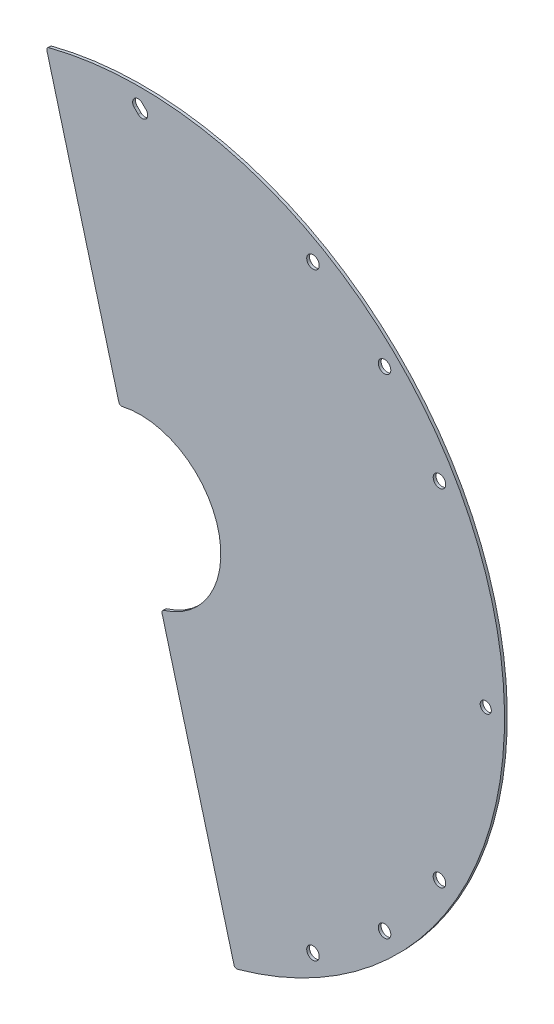
ISO-10303-21;
HEADER;
FILE_DESCRIPTION(('STEP AP214'),'2;1');
FILE_NAME('part.step','',(''),(''),'','','');
FILE_SCHEMA(('AUTOMOTIVE_DESIGN { 1 0 10303 214 1 1 1 1 }'));
ENDSEC;
DATA;
#1=APPLICATION_CONTEXT('core data for automotive mechanical design processes');
#2=APPLICATION_PROTOCOL_DEFINITION('international standard','automotive_design',2000,#1);
#3=PRODUCT_CONTEXT('',#1,'mechanical');
#4=PRODUCT('Part','Part','',(#3));
#5=PRODUCT_RELATED_PRODUCT_CATEGORY('part','',(#4));
#6=PRODUCT_DEFINITION_FORMATION('','',#4);
#7=PRODUCT_DEFINITION_CONTEXT('part definition',#1,'design');
#8=PRODUCT_DEFINITION('design','',#6,#7);
#9=PRODUCT_DEFINITION_SHAPE('','',#8);
#10=(LENGTH_UNIT() NAMED_UNIT(*) SI_UNIT(.MILLI.,.METRE.));
#11=(NAMED_UNIT(*) PLANE_ANGLE_UNIT() SI_UNIT($,.RADIAN.));
#12=(NAMED_UNIT(*) SI_UNIT($,.STERADIAN.) SOLID_ANGLE_UNIT());
#13=UNCERTAINTY_MEASURE_WITH_UNIT(LENGTH_MEASURE(1.E-05),#10,'distance_accuracy_value','');
#14=(GEOMETRIC_REPRESENTATION_CONTEXT(3) GLOBAL_UNCERTAINTY_ASSIGNED_CONTEXT((#13)) GLOBAL_UNIT_ASSIGNED_CONTEXT((#10,
#11,#12)) REPRESENTATION_CONTEXT('',''));
#15=CARTESIAN_POINT('',(0.,0.,0.));
#16=DIRECTION('',(0.,0.,1.));
#17=DIRECTION('',(1.,0.,0.));
#18=AXIS2_PLACEMENT_3D('',#15,#16,#17);
#19=CARTESIAN_POINT('',(-33.9052949084303,126.536283243868,0.999999999999994));
#20=DIRECTION('',(0.,0.,1.));
#21=DIRECTION('',(1.,0.,0.));
#22=AXIS2_PLACEMENT_3D('',#19,#20,#21);
#23=PLANE('',#22);
#24=CARTESIAN_POINT('',(0.,0.,0.999999999999987));
#25=DIRECTION('',(0.,0.,-1.));
#26=DIRECTION('',(-1.,0.,0.));
#27=AXIS2_PLACEMENT_3D('',#24,#25,#26);
#28=CIRCLE('',#27,29.);
#29=CARTESIAN_POINT('',(-6.473603948856,28.2682233596906,0.999999999999987));
#30=VERTEX_POINT('',#29);
#31=CARTESIAN_POINT('',(8.52780620609657,-27.7178015237728,0.999999999999987));
#32=VERTEX_POINT('',#31);
#33=EDGE_CURVE('E211',#30,#32,#28,.T.);
#34=ORIENTED_EDGE('',*,*,#33,.T.);
#35=CARTESIAN_POINT('',(8.82186848906542,-28.6735877832132,0.999999999999994));
#36=DIRECTION('',(0.,0.,1.));
#37=DIRECTION('',(1.,0.,0.));
#38=AXIS2_PLACEMENT_3D('',#35,#36,#37);
#39=CIRCLE('',#38,1.);
#40=CARTESIAN_POINT('',(7.85594266277633,-28.9324068283157,0.999999999999994));
#41=VERTEX_POINT('',#40);
#42=EDGE_CURVE('E235',#32,#41,#39,.T.);
#43=ORIENTED_EDGE('',*,*,#42,.T.);
#44=DIRECTION('',(-0.258819045102518,0.965925826289069,0.));
#45=VECTOR('',#44,1.);
#46=CARTESIAN_POINT('',(-33.8087023258014,126.562165148378,0.999999999999994));
#47=LINE('',#46,#45);
#48=CARTESIAN_POINT('',(33.7418639203775,-125.539980162412,0.999999999999994));
#49=VERTEX_POINT('',#48);
#50=EDGE_CURVE('E265',#49,#41,#47,.T.);
#51=ORIENTED_EDGE('',*,*,#50,.F.);
#52=CARTESIAN_POINT('',(34.7077897466666,-125.281161117309,0.999999999999994));
#53=DIRECTION('',(0.,0.,1.));
#54=DIRECTION('',(1.,0.,0.));
#55=AXIS2_PLACEMENT_3D('',#52,#53,#54);
#56=CIRCLE('',#55,1.);
#57=CARTESIAN_POINT('',(34.9747727447179,-126.244862356673,1.));
#58=VERTEX_POINT('',#57);
#59=EDGE_CURVE('E231',#49,#58,#56,.T.);
#60=ORIENTED_EDGE('',*,*,#59,.T.);
#61=CARTESIAN_POINT('',(0.,0.,1.));
#62=DIRECTION('',(0.,0.,-1.));
#63=DIRECTION('',(-1.,0.,0.));
#64=AXIS2_PLACEMENT_3D('',#61,#62,#63);
#65=CIRCLE('',#64,131.);
#66=CARTESIAN_POINT('',(-32.8333894898225,126.818644270508,1.));
#67=VERTEX_POINT('',#66);
#68=EDGE_CURVE('E220',#67,#58,#65,.T.);
#69=ORIENTED_EDGE('',*,*,#68,.F.);
#70=CARTESIAN_POINT('',(-32.5827529288315,125.850563016535,0.999999999999994));
#71=DIRECTION('',(0.,0.,1.));
#72=DIRECTION('',(1.,0.,0.));
#73=AXIS2_PLACEMENT_3D('',#70,#71,#72);
#74=CIRCLE('',#73,1.);
#75=CARTESIAN_POINT('',(-33.5486787551206,125.591743971432,0.999999999999994));
#76=VERTEX_POINT('',#75);
#77=EDGE_CURVE('E229',#67,#76,#74,.T.);
#78=ORIENTED_EDGE('',*,*,#77,.T.);
#79=CARTESIAN_POINT('',(-7.66275749751943,28.984170637336,0.999999999999994));
#80=VERTEX_POINT('',#79);
#81=EDGE_CURVE('E152',#80,#76,#47,.T.);
#82=ORIENTED_EDGE('',*,*,#81,.F.);
#83=CARTESIAN_POINT('',(-6.69683167123034,29.2429896824385,0.999999999999994));
#84=DIRECTION('',(0.,0.,1.));
#85=DIRECTION('',(1.,0.,0.));
#86=AXIS2_PLACEMENT_3D('',#83,#84,#85);
#87=CIRCLE('',#86,1.);
#88=EDGE_CURVE('E233',#80,#30,#87,.T.);
#89=ORIENTED_EDGE('',*,*,#88,.T.);
#90=EDGE_LOOP('',(#34,#43,#51,#60,#69,#78,#82,#89));
#91=FACE_BOUND('',#90,.T.);
#92=DIRECTION('',(-0.707106781186549,0.707106781186546,0.));
#93=VECTOR('',#92,1.);
#94=CARTESIAN_POINT('',(0.70710678118611,126.37132034356,0.999999999999994));
#95=LINE('',#94,#93);
#96=CARTESIAN_POINT('',(2.12132034355921,124.957106781187,0.999999999999994));
#97=VERTEX_POINT('',#96);
#98=CARTESIAN_POINT('',(0.70710678118611,126.37132034356,0.999999999999994));
#99=VERTEX_POINT('',#98);
#100=EDGE_CURVE('E147',#97,#99,#95,.T.);
#101=ORIENTED_EDGE('',*,*,#100,.F.);
#102=CARTESIAN_POINT('',(0.707106781186083,123.542893218813,0.999999999999994));
#103=DIRECTION('',(0.,0.,1.));
#104=DIRECTION('',(1.,0.,0.));
#105=AXIS2_PLACEMENT_3D('',#102,#103,#104);
#106=CIRCLE('',#105,1.99999999999999);
#107=CARTESIAN_POINT('',(-0.707106781187008,122.12867965644,0.999999999999994));
#108=VERTEX_POINT('',#107);
#109=EDGE_CURVE('E149',#108,#97,#106,.T.);
#110=ORIENTED_EDGE('',*,*,#109,.F.);
#111=DIRECTION('',(0.707106781186547,-0.707106781186547,0.));
#112=VECTOR('',#111,1.);
#113=CARTESIAN_POINT('',(-2.12132034356007,123.542893218813,0.999999999999994));
#114=LINE('',#113,#112);
#115=CARTESIAN_POINT('',(-2.12132034356007,123.542893218813,0.999999999999994));
#116=VERTEX_POINT('',#115);
#117=EDGE_CURVE('E158',#116,#108,#114,.T.);
#118=ORIENTED_EDGE('',*,*,#117,.F.);
#119=CARTESIAN_POINT('',(-0.707106781187007,124.957106781187,0.999999999999994));
#120=DIRECTION('',(0.,0.,1.));
#121=DIRECTION('',(1.,0.,0.));
#122=AXIS2_PLACEMENT_3D('',#119,#120,#121);
#123=CIRCLE('',#122,1.99999999999999);
#124=EDGE_CURVE('E141',#99,#116,#123,.T.);
#125=ORIENTED_EDGE('',*,*,#124,.F.);
#126=EDGE_LOOP('',(#101,#110,#118,#125));
#127=FACE_BOUND('',#126,.T.);
#128=CARTESIAN_POINT('',(87.8580175624287,-87.8580175624283,0.999999999999995));
#129=DIRECTION('',(0.,0.,1.));
#130=DIRECTION('',(1.,0.,0.));
#131=AXIS2_PLACEMENT_3D('',#128,#129,#130);
#132=CIRCLE('',#131,2.24999999999999);
#133=CARTESIAN_POINT('',(90.1080175624287,-87.8580175624283,0.999999999999995));
#134=VERTEX_POINT('',#133);
#135=EDGE_CURVE('E165',#134,#134,#132,.T.);
#136=ORIENTED_EDGE('',*,*,#135,.F.);
#137=EDGE_LOOP('',(#136));
#138=FACE_BOUND('',#137,.T.);
#139=CARTESIAN_POINT('',(87.858017562428,87.858017562429,0.999999999999995));
#140=DIRECTION('',(0.,0.,1.));
#141=DIRECTION('',(1.,0.,0.));
#142=AXIS2_PLACEMENT_3D('',#139,#140,#141);
#143=CIRCLE('',#142,2.24999999999999);
#144=CARTESIAN_POINT('',(90.108017562428,87.858017562429,0.999999999999995));
#145=VERTEX_POINT('',#144);
#146=EDGE_CURVE('E175',#145,#145,#143,.T.);
#147=ORIENTED_EDGE('',*,*,#146,.F.);
#148=EDGE_LOOP('',(#147));
#149=FACE_BOUND('',#148,.T.);
#150=CARTESIAN_POINT('',(124.25,0.,0.999999999999994));
#151=DIRECTION('',(0.,0.,1.));
#152=DIRECTION('',(1.,0.,0.));
#153=AXIS2_PLACEMENT_3D('',#150,#151,#152);
#154=CIRCLE('',#153,2.);
#155=CARTESIAN_POINT('',(126.25,0.,0.999999999999994));
#156=VERTEX_POINT('',#155);
#157=EDGE_CURVE('E181',#156,#156,#154,.T.);
#158=ORIENTED_EDGE('',*,*,#157,.F.);
#159=EDGE_LOOP('',(#158));
#160=FACE_BOUND('',#159,.T.);
#161=CARTESIAN_POINT('',(107.603656420215,62.125000000002,0.999999999999995));
#162=DIRECTION('',(0.,0.,1.));
#163=DIRECTION('',(1.,0.,0.));
#164=AXIS2_PLACEMENT_3D('',#161,#162,#163);
#165=CIRCLE('',#164,2.24999999999999);
#166=CARTESIAN_POINT('',(109.853656420215,62.125000000002,0.999999999999995));
#167=VERTEX_POINT('',#166);
#168=EDGE_CURVE('E187',#167,#167,#165,.T.);
#169=ORIENTED_EDGE('',*,*,#168,.F.);
#170=EDGE_LOOP('',(#169));
#171=FACE_BOUND('',#170,.T.);
#172=CARTESIAN_POINT('',(107.603656420218,-62.1249999999982,0.999999999999995));
#173=DIRECTION('',(0.,0.,1.));
#174=DIRECTION('',(1.,0.,0.));
#175=AXIS2_PLACEMENT_3D('',#172,#173,#174);
#176=CIRCLE('',#175,2.24999999999999);
#177=CARTESIAN_POINT('',(109.853656420218,-62.1249999999982,0.999999999999995));
#178=VERTEX_POINT('',#177);
#179=EDGE_CURVE('E193',#178,#178,#176,.T.);
#180=ORIENTED_EDGE('',*,*,#179,.F.);
#181=EDGE_LOOP('',(#180));
#182=FACE_BOUND('',#181,.T.);
#183=CARTESIAN_POINT('',(62.1250000000016,-107.603656420216,0.999999999999995));
#184=DIRECTION('',(0.,0.,1.));
#185=DIRECTION('',(1.,0.,0.));
#186=AXIS2_PLACEMENT_3D('',#183,#184,#185);
#187=CIRCLE('',#186,2.24999999999999);
#188=CARTESIAN_POINT('',(64.3750000000016,-107.603656420216,0.999999999999995));
#189=VERTEX_POINT('',#188);
#190=EDGE_CURVE('E199',#189,#189,#187,.T.);
#191=ORIENTED_EDGE('',*,*,#190,.F.);
#192=EDGE_LOOP('',(#191));
#193=FACE_BOUND('',#192,.T.);
#194=CARTESIAN_POINT('',(62.1249999999993,107.603656420217,0.999999999999995));
#195=DIRECTION('',(0.,0.,1.));
#196=DIRECTION('',(1.,0.,0.));
#197=AXIS2_PLACEMENT_3D('',#194,#195,#196);
#198=CIRCLE('',#197,2.24999999999999);
#199=CARTESIAN_POINT('',(64.3749999999993,107.603656420217,0.999999999999995));
#200=VERTEX_POINT('',#199);
#201=EDGE_CURVE('E205',#200,#200,#198,.T.);
#202=ORIENTED_EDGE('',*,*,#201,.F.);
#203=EDGE_LOOP('',(#202));
#204=FACE_BOUND('',#203,.T.);
#205=ADVANCED_FACE('F32',(#91,#127,#138,#149,#160,#171,#182,#193,#204),#23,.T.);
#206=CARTESIAN_POINT('',(0.,0.,0.));
#207=DIRECTION('',(0.,0.,-1.));
#208=DIRECTION('',(-1.,0.,0.));
#209=AXIS2_PLACEMENT_3D('',#206,#207,#208);
#210=CYLINDRICAL_SURFACE('',#209,131.);
#211=ORIENTED_EDGE('',*,*,#68,.T.);
#212=DIRECTION('',(0.,0.,-1.));
#213=VECTOR('',#212,1.);
#214=CARTESIAN_POINT('',(34.9747727447179,-126.244862356673,0.));
#215=LINE('',#214,#213);
#216=CARTESIAN_POINT('',(34.9747727447179,-126.244862356673,0.));
#217=VERTEX_POINT('',#216);
#218=EDGE_CURVE('E11',#58,#217,#215,.T.);
#219=ORIENTED_EDGE('',*,*,#218,.T.);
#220=CARTESIAN_POINT('',(0.,0.,0.));
#221=DIRECTION('',(0.,0.,-1.));
#222=DIRECTION('',(-1.,0.,0.));
#223=AXIS2_PLACEMENT_3D('',#220,#221,#222);
#224=CIRCLE('',#223,131.);
#225=CARTESIAN_POINT('',(-32.8333894898225,126.818644270508,0.));
#226=VERTEX_POINT('',#225);
#227=EDGE_CURVE('E217',#226,#217,#224,.T.);
#228=ORIENTED_EDGE('',*,*,#227,.F.);
#229=DIRECTION('',(0.,0.,-1.));
#230=VECTOR('',#229,1.);
#231=CARTESIAN_POINT('',(-32.8333894898225,126.818644270508,0.));
#232=LINE('',#231,#230);
#233=EDGE_CURVE('E40',#226,#67,#232,.F.);
#234=ORIENTED_EDGE('',*,*,#233,.T.);
#235=EDGE_LOOP('',(#211,#219,#228,#234));
#236=FACE_BOUND('',#235,.T.);
#237=ADVANCED_FACE('F255',(#236),#210,.T.);
#238=CARTESIAN_POINT('',(-33.9052949084303,126.536283243868,0.));
#239=DIRECTION('',(0.,0.,1.));
#240=DIRECTION('',(1.,0.,0.));
#241=AXIS2_PLACEMENT_3D('',#238,#239,#240);
#242=PLANE('',#241);
#243=CARTESIAN_POINT('',(87.8580175624287,-87.8580175624283,0.));
#244=DIRECTION('',(0.,0.,1.));
#245=DIRECTION('',(1.,0.,0.));
#246=AXIS2_PLACEMENT_3D('',#243,#244,#245);
#247=CIRCLE('',#246,2.25);
#248=CARTESIAN_POINT('',(90.1080175624287,-87.8580175624283,0.));
#249=VERTEX_POINT('',#248);
#250=EDGE_CURVE('E172',#249,#249,#247,.T.);
#251=ORIENTED_EDGE('',*,*,#250,.T.);
#252=EDGE_LOOP('',(#251));
#253=FACE_BOUND('',#252,.T.);
#254=CARTESIAN_POINT('',(87.858017562428,87.858017562429,0.));
#255=DIRECTION('',(0.,0.,1.));
#256=DIRECTION('',(1.,0.,0.));
#257=AXIS2_PLACEMENT_3D('',#254,#255,#256);
#258=CIRCLE('',#257,2.25);
#259=CARTESIAN_POINT('',(90.108017562428,87.858017562429,0.));
#260=VERTEX_POINT('',#259);
#261=EDGE_CURVE('E178',#260,#260,#258,.T.);
#262=ORIENTED_EDGE('',*,*,#261,.T.);
#263=EDGE_LOOP('',(#262));
#264=FACE_BOUND('',#263,.T.);
#265=CARTESIAN_POINT('',(0.707106781186083,123.542893218813,0.));
#266=DIRECTION('',(0.,0.,1.));
#267=DIRECTION('',(1.,0.,0.));
#268=AXIS2_PLACEMENT_3D('',#265,#266,#267);
#269=CIRCLE('',#268,1.99999999999999);
#270=CARTESIAN_POINT('',(-0.707106781187006,122.12867965644,0.));
#271=VERTEX_POINT('',#270);
#272=CARTESIAN_POINT('',(2.12132034355921,124.957106781187,0.));
#273=VERTEX_POINT('',#272);
#274=EDGE_CURVE('E132',#271,#273,#269,.T.);
#275=ORIENTED_EDGE('',*,*,#274,.T.);
#276=DIRECTION('',(-0.707106781186549,0.707106781186546,0.));
#277=VECTOR('',#276,1.);
#278=CARTESIAN_POINT('',(0.70710678118611,126.37132034356,0.));
#279=LINE('',#278,#277);
#280=CARTESIAN_POINT('',(0.70710678118611,126.37132034356,0.));
#281=VERTEX_POINT('',#280);
#282=EDGE_CURVE('E143',#273,#281,#279,.T.);
#283=ORIENTED_EDGE('',*,*,#282,.T.);
#284=CARTESIAN_POINT('',(-0.707106781187007,124.957106781187,0.));
#285=DIRECTION('',(0.,0.,1.));
#286=DIRECTION('',(1.,0.,0.));
#287=AXIS2_PLACEMENT_3D('',#284,#285,#286);
#288=CIRCLE('',#287,1.99999999999999);
#289=CARTESIAN_POINT('',(-2.12132034356007,123.542893218813,0.));
#290=VERTEX_POINT('',#289);
#291=EDGE_CURVE('E133',#281,#290,#288,.T.);
#292=ORIENTED_EDGE('',*,*,#291,.T.);
#293=DIRECTION('',(0.707106781186547,-0.707106781186547,0.));
#294=VECTOR('',#293,1.);
#295=CARTESIAN_POINT('',(-2.12132034356007,123.542893218813,0.));
#296=LINE('',#295,#294);
#297=EDGE_CURVE('E122',#290,#271,#296,.T.);
#298=ORIENTED_EDGE('',*,*,#297,.T.);
#299=EDGE_LOOP('',(#275,#283,#292,#298));
#300=FACE_BOUND('',#299,.T.);
#301=CARTESIAN_POINT('',(124.25,0.,0.));
#302=DIRECTION('',(0.,0.,1.));
#303=DIRECTION('',(1.,0.,0.));
#304=AXIS2_PLACEMENT_3D('',#301,#302,#303);
#305=CIRCLE('',#304,2.);
#306=CARTESIAN_POINT('',(126.25,0.,0.));
#307=VERTEX_POINT('',#306);
#308=EDGE_CURVE('E184',#307,#307,#305,.T.);
#309=ORIENTED_EDGE('',*,*,#308,.T.);
#310=EDGE_LOOP('',(#309));
#311=FACE_BOUND('',#310,.T.);
#312=CARTESIAN_POINT('',(107.603656420215,62.125000000002,0.));
#313=DIRECTION('',(0.,0.,1.));
#314=DIRECTION('',(1.,0.,0.));
#315=AXIS2_PLACEMENT_3D('',#312,#313,#314);
#316=CIRCLE('',#315,2.25);
#317=CARTESIAN_POINT('',(109.853656420215,62.125000000002,0.));
#318=VERTEX_POINT('',#317);
#319=EDGE_CURVE('E190',#318,#318,#316,.T.);
#320=ORIENTED_EDGE('',*,*,#319,.T.);
#321=EDGE_LOOP('',(#320));
#322=FACE_BOUND('',#321,.T.);
#323=CARTESIAN_POINT('',(107.603656420218,-62.1249999999982,0.));
#324=DIRECTION('',(0.,0.,1.));
#325=DIRECTION('',(1.,0.,0.));
#326=AXIS2_PLACEMENT_3D('',#323,#324,#325);
#327=CIRCLE('',#326,2.25);
#328=CARTESIAN_POINT('',(109.853656420218,-62.1249999999982,0.));
#329=VERTEX_POINT('',#328);
#330=EDGE_CURVE('E196',#329,#329,#327,.T.);
#331=ORIENTED_EDGE('',*,*,#330,.T.);
#332=EDGE_LOOP('',(#331));
#333=FACE_BOUND('',#332,.T.);
#334=CARTESIAN_POINT('',(62.1250000000016,-107.603656420216,0.));
#335=DIRECTION('',(0.,0.,1.));
#336=DIRECTION('',(1.,0.,0.));
#337=AXIS2_PLACEMENT_3D('',#334,#335,#336);
#338=CIRCLE('',#337,2.25);
#339=CARTESIAN_POINT('',(64.3750000000016,-107.603656420216,0.));
#340=VERTEX_POINT('',#339);
#341=EDGE_CURVE('E202',#340,#340,#338,.T.);
#342=ORIENTED_EDGE('',*,*,#341,.T.);
#343=EDGE_LOOP('',(#342));
#344=FACE_BOUND('',#343,.T.);
#345=CARTESIAN_POINT('',(62.1249999999993,107.603656420217,0.));
#346=DIRECTION('',(0.,0.,1.));
#347=DIRECTION('',(1.,0.,0.));
#348=AXIS2_PLACEMENT_3D('',#345,#346,#347);
#349=CIRCLE('',#348,2.25);
#350=CARTESIAN_POINT('',(64.3749999999993,107.603656420217,0.));
#351=VERTEX_POINT('',#350);
#352=EDGE_CURVE('E208',#351,#351,#349,.T.);
#353=ORIENTED_EDGE('',*,*,#352,.T.);
#354=EDGE_LOOP('',(#353));
#355=FACE_BOUND('',#354,.T.);
#356=DIRECTION('',(-0.258819045102518,0.965925826289069,0.));
#357=VECTOR('',#356,1.);
#358=CARTESIAN_POINT('',(-33.8087023258014,126.562165148378,0.));
#359=LINE('',#358,#357);
#360=CARTESIAN_POINT('',(33.7418639203775,-125.539980162412,0.));
#361=VERTEX_POINT('',#360);
#362=CARTESIAN_POINT('',(7.85594266277633,-28.9324068283157,0.));
#363=VERTEX_POINT('',#362);
#364=EDGE_CURVE('E159',#361,#363,#359,.T.);
#365=ORIENTED_EDGE('',*,*,#364,.T.);
#366=CARTESIAN_POINT('',(8.82186848906542,-28.6735877832132,0.));
#367=DIRECTION('',(0.,0.,1.));
#368=DIRECTION('',(1.,0.,0.));
#369=AXIS2_PLACEMENT_3D('',#366,#367,#368);
#370=CIRCLE('',#369,1.);
#371=CARTESIAN_POINT('',(8.52780620609657,-27.7178015237728,0.));
#372=VERTEX_POINT('',#371);
#373=EDGE_CURVE('E246',#363,#372,#370,.F.);
#374=ORIENTED_EDGE('',*,*,#373,.T.);
#375=CARTESIAN_POINT('',(0.,0.,0.));
#376=DIRECTION('',(0.,0.,-1.));
#377=DIRECTION('',(-1.,0.,0.));
#378=AXIS2_PLACEMENT_3D('',#375,#376,#377);
#379=CIRCLE('',#378,29.);
#380=CARTESIAN_POINT('',(-6.473603948856,28.2682233596906,0.));
#381=VERTEX_POINT('',#380);
#382=EDGE_CURVE('E214',#381,#372,#379,.T.);
#383=ORIENTED_EDGE('',*,*,#382,.F.);
#384=CARTESIAN_POINT('',(-6.69683167123034,29.2429896824385,0.));
#385=DIRECTION('',(0.,0.,1.));
#386=DIRECTION('',(1.,0.,0.));
#387=AXIS2_PLACEMENT_3D('',#384,#385,#386);
#388=CIRCLE('',#387,1.);
#389=CARTESIAN_POINT('',(-7.66275749751943,28.984170637336,0.));
#390=VERTEX_POINT('',#389);
#391=EDGE_CURVE('E54',#381,#390,#388,.F.);
#392=ORIENTED_EDGE('',*,*,#391,.T.);
#393=CARTESIAN_POINT('',(-33.5486787551206,125.591743971432,0.));
#394=VERTEX_POINT('',#393);
#395=EDGE_CURVE('E271',#390,#394,#359,.T.);
#396=ORIENTED_EDGE('',*,*,#395,.T.);
#397=CARTESIAN_POINT('',(-32.5827529288315,125.850563016535,0.));
#398=DIRECTION('',(0.,0.,1.));
#399=DIRECTION('',(1.,0.,0.));
#400=AXIS2_PLACEMENT_3D('',#397,#398,#399);
#401=CIRCLE('',#400,1.);
#402=EDGE_CURVE('E241',#394,#226,#401,.F.);
#403=ORIENTED_EDGE('',*,*,#402,.T.);
#404=ORIENTED_EDGE('',*,*,#227,.T.);
#405=CARTESIAN_POINT('',(34.7077897466666,-125.281161117309,0.));
#406=DIRECTION('',(0.,0.,1.));
#407=DIRECTION('',(1.,0.,0.));
#408=AXIS2_PLACEMENT_3D('',#405,#406,#407);
#409=CIRCLE('',#408,1.);
#410=EDGE_CURVE('E243',#217,#361,#409,.F.);
#411=ORIENTED_EDGE('',*,*,#410,.T.);
#412=EDGE_LOOP('',(#365,#374,#383,#392,#396,#403,#404,#411));
#413=FACE_BOUND('',#412,.T.);
#414=ADVANCED_FACE('F145',(#253,#264,#300,#311,#322,#333,#344,#355,#413),#242,.F.);
#415=CARTESIAN_POINT('',(0.,0.,0.));
#416=DIRECTION('',(0.,0.,-1.));
#417=DIRECTION('',(-1.,0.,0.));
#418=AXIS2_PLACEMENT_3D('',#415,#416,#417);
#419=CYLINDRICAL_SURFACE('',#418,29.);
#420=ORIENTED_EDGE('',*,*,#382,.T.);
#421=DIRECTION('',(0.,0.,-1.));
#422=VECTOR('',#421,1.);
#423=CARTESIAN_POINT('',(8.52780620609657,-27.7178015237728,0.));
#424=LINE('',#423,#422);
#425=EDGE_CURVE('E226',#372,#32,#424,.F.);
#426=ORIENTED_EDGE('',*,*,#425,.T.);
#427=ORIENTED_EDGE('',*,*,#33,.F.);
#428=DIRECTION('',(0.,0.,-1.));
#429=VECTOR('',#428,1.);
#430=CARTESIAN_POINT('',(-6.473603948856,28.2682233596906,0.));
#431=LINE('',#430,#429);
#432=EDGE_CURVE('E223',#30,#381,#431,.T.);
#433=ORIENTED_EDGE('',*,*,#432,.T.);
#434=EDGE_LOOP('',(#420,#426,#427,#433));
#435=FACE_BOUND('',#434,.T.);
#436=ADVANCED_FACE('F287',(#435),#419,.F.);
#437=CARTESIAN_POINT('',(62.1249999999993,107.603656420217,0.999999999999994));
#438=DIRECTION('',(0.,0.,1.));
#439=DIRECTION('',(1.,0.,0.));
#440=AXIS2_PLACEMENT_3D('',#437,#438,#439);
#441=CYLINDRICAL_SURFACE('',#440,2.25);
#442=ORIENTED_EDGE('',*,*,#352,.F.);
#443=EDGE_LOOP('',(#442));
#444=FACE_BOUND('',#443,.T.);
#445=ORIENTED_EDGE('',*,*,#201,.T.);
#446=EDGE_LOOP('',(#445));
#447=FACE_BOUND('',#446,.T.);
#448=ADVANCED_FACE('F285',(#444,#447),#441,.F.);
#449=CARTESIAN_POINT('',(62.1250000000016,-107.603656420216,0.999999999999994));
#450=DIRECTION('',(0.,0.,1.));
#451=DIRECTION('',(1.,0.,0.));
#452=AXIS2_PLACEMENT_3D('',#449,#450,#451);
#453=CYLINDRICAL_SURFACE('',#452,2.25);
#454=ORIENTED_EDGE('',*,*,#341,.F.);
#455=EDGE_LOOP('',(#454));
#456=FACE_BOUND('',#455,.T.);
#457=ORIENTED_EDGE('',*,*,#190,.T.);
#458=EDGE_LOOP('',(#457));
#459=FACE_BOUND('',#458,.T.);
#460=ADVANCED_FACE('F348',(#456,#459),#453,.F.);
#461=CARTESIAN_POINT('',(107.603656420218,-62.1249999999982,0.999999999999994));
#462=DIRECTION('',(0.,0.,1.));
#463=DIRECTION('',(1.,0.,0.));
#464=AXIS2_PLACEMENT_3D('',#461,#462,#463);
#465=CYLINDRICAL_SURFACE('',#464,2.25);
#466=ORIENTED_EDGE('',*,*,#330,.F.);
#467=EDGE_LOOP('',(#466));
#468=FACE_BOUND('',#467,.T.);
#469=ORIENTED_EDGE('',*,*,#179,.T.);
#470=EDGE_LOOP('',(#469));
#471=FACE_BOUND('',#470,.T.);
#472=ADVANCED_FACE('F345',(#468,#471),#465,.F.);
#473=CARTESIAN_POINT('',(107.603656420215,62.125000000002,0.999999999999994));
#474=DIRECTION('',(0.,0.,1.));
#475=DIRECTION('',(1.,0.,0.));
#476=AXIS2_PLACEMENT_3D('',#473,#474,#475);
#477=CYLINDRICAL_SURFACE('',#476,2.25);
#478=ORIENTED_EDGE('',*,*,#319,.F.);
#479=EDGE_LOOP('',(#478));
#480=FACE_BOUND('',#479,.T.);
#481=ORIENTED_EDGE('',*,*,#168,.T.);
#482=EDGE_LOOP('',(#481));
#483=FACE_BOUND('',#482,.T.);
#484=ADVANCED_FACE('F341',(#480,#483),#477,.F.);
#485=CARTESIAN_POINT('',(124.25,0.,0.999999999999994));
#486=DIRECTION('',(0.,0.,1.));
#487=DIRECTION('',(1.,0.,0.));
#488=AXIS2_PLACEMENT_3D('',#485,#486,#487);
#489=CYLINDRICAL_SURFACE('',#488,2.);
#490=ORIENTED_EDGE('',*,*,#308,.F.);
#491=EDGE_LOOP('',(#490));
#492=FACE_BOUND('',#491,.T.);
#493=ORIENTED_EDGE('',*,*,#157,.T.);
#494=EDGE_LOOP('',(#493));
#495=FACE_BOUND('',#494,.T.);
#496=ADVANCED_FACE('F337',(#492,#495),#489,.F.);
#497=CARTESIAN_POINT('',(87.858017562428,87.858017562429,0.999999999999994));
#498=DIRECTION('',(0.,0.,1.));
#499=DIRECTION('',(1.,0.,0.));
#500=AXIS2_PLACEMENT_3D('',#497,#498,#499);
#501=CYLINDRICAL_SURFACE('',#500,2.25);
#502=ORIENTED_EDGE('',*,*,#261,.F.);
#503=EDGE_LOOP('',(#502));
#504=FACE_BOUND('',#503,.T.);
#505=ORIENTED_EDGE('',*,*,#146,.T.);
#506=EDGE_LOOP('',(#505));
#507=FACE_BOUND('',#506,.T.);
#508=ADVANCED_FACE('F333',(#504,#507),#501,.F.);
#509=CARTESIAN_POINT('',(87.8580175624287,-87.8580175624283,0.999999999999994));
#510=DIRECTION('',(0.,0.,1.));
#511=DIRECTION('',(1.,0.,0.));
#512=AXIS2_PLACEMENT_3D('',#509,#510,#511);
#513=CYLINDRICAL_SURFACE('',#512,2.25);
#514=ORIENTED_EDGE('',*,*,#250,.F.);
#515=EDGE_LOOP('',(#514));
#516=FACE_BOUND('',#515,.T.);
#517=ORIENTED_EDGE('',*,*,#135,.T.);
#518=EDGE_LOOP('',(#517));
#519=FACE_BOUND('',#518,.T.);
#520=ADVANCED_FACE('F324',(#516,#519),#513,.F.);
#521=CARTESIAN_POINT('',(0.70710678118611,126.37132034356,0.));
#522=DIRECTION('',(0.707106781186546,0.707106781186549,0.));
#523=DIRECTION('',(-0.707106781186549,0.707106781186546,0.));
#524=AXIS2_PLACEMENT_3D('',#521,#522,#523);
#525=PLANE('',#524);
#526=ORIENTED_EDGE('',*,*,#100,.T.);
#527=DIRECTION('',(0.,0.,1.));
#528=VECTOR('',#527,1.);
#529=CARTESIAN_POINT('',(0.70710678118611,126.37132034356,0.));
#530=LINE('',#529,#528);
#531=EDGE_CURVE('E163',#281,#99,#530,.T.);
#532=ORIENTED_EDGE('',*,*,#531,.F.);
#533=ORIENTED_EDGE('',*,*,#282,.F.);
#534=DIRECTION('',(0.,0.,1.));
#535=VECTOR('',#534,1.);
#536=CARTESIAN_POINT('',(2.12132034355921,124.957106781187,0.));
#537=LINE('',#536,#535);
#538=EDGE_CURVE('E166',#273,#97,#537,.T.);
#539=ORIENTED_EDGE('',*,*,#538,.T.);
#540=EDGE_LOOP('',(#526,#532,#533,#539));
#541=FACE_BOUND('',#540,.T.);
#542=ADVANCED_FACE('F322',(#541),#525,.F.);
#543=CARTESIAN_POINT('',(-2.12132034356007,123.542893218813,0.));
#544=DIRECTION('',(-0.707106781186547,-0.707106781186547,0.));
#545=DIRECTION('',(0.707106781186548,-0.707106781186548,0.));
#546=AXIS2_PLACEMENT_3D('',#543,#544,#545);
#547=PLANE('',#546);
#548=ORIENTED_EDGE('',*,*,#117,.T.);
#549=DIRECTION('',(0.,0.,1.));
#550=VECTOR('',#549,1.);
#551=CARTESIAN_POINT('',(-0.707106781187008,122.12867965644,0.));
#552=LINE('',#551,#550);
#553=EDGE_CURVE('E128',#271,#108,#552,.T.);
#554=ORIENTED_EDGE('',*,*,#553,.F.);
#555=ORIENTED_EDGE('',*,*,#297,.F.);
#556=DIRECTION('',(0.,0.,1.));
#557=VECTOR('',#556,1.);
#558=CARTESIAN_POINT('',(-2.12132034356007,123.542893218813,0.));
#559=LINE('',#558,#557);
#560=EDGE_CURVE('E125',#290,#116,#559,.T.);
#561=ORIENTED_EDGE('',*,*,#560,.T.);
#562=EDGE_LOOP('',(#548,#554,#555,#561));
#563=FACE_BOUND('',#562,.T.);
#564=ADVANCED_FACE('F124',(#563),#547,.F.);
#565=CARTESIAN_POINT('',(-0.707106781187007,124.957106781187,0.));
#566=DIRECTION('',(0.,0.,1.));
#567=DIRECTION('',(1.,0.,0.));
#568=AXIS2_PLACEMENT_3D('',#565,#566,#567);
#569=CYLINDRICAL_SURFACE('',#568,1.99999999999999);
#570=ORIENTED_EDGE('',*,*,#124,.T.);
#571=ORIENTED_EDGE('',*,*,#560,.F.);
#572=ORIENTED_EDGE('',*,*,#291,.F.);
#573=ORIENTED_EDGE('',*,*,#531,.T.);
#574=EDGE_LOOP('',(#570,#571,#572,#573));
#575=FACE_BOUND('',#574,.T.);
#576=ADVANCED_FACE('F137',(#575),#569,.F.);
#577=CARTESIAN_POINT('',(0.707106781186083,123.542893218813,0.));
#578=DIRECTION('',(0.,0.,1.));
#579=DIRECTION('',(1.,0.,0.));
#580=AXIS2_PLACEMENT_3D('',#577,#578,#579);
#581=CYLINDRICAL_SURFACE('',#580,1.99999999999999);
#582=ORIENTED_EDGE('',*,*,#109,.T.);
#583=ORIENTED_EDGE('',*,*,#538,.F.);
#584=ORIENTED_EDGE('',*,*,#274,.F.);
#585=ORIENTED_EDGE('',*,*,#553,.T.);
#586=EDGE_LOOP('',(#582,#583,#584,#585));
#587=FACE_BOUND('',#586,.T.);
#588=ADVANCED_FACE('F313',(#587),#581,.F.);
#589=CARTESIAN_POINT('',(-33.8087023258014,126.562165148378,0.));
#590=DIRECTION('',(0.965925826289069,0.258819045102518,0.));
#591=DIRECTION('',(-0.258819045102518,0.965925826289069,0.));
#592=AXIS2_PLACEMENT_3D('',#589,#590,#591);
#593=PLANE('',#592);
#594=ORIENTED_EDGE('',*,*,#395,.F.);
#595=DIRECTION('',(0.,0.,-1.));
#596=VECTOR('',#595,1.);
#597=CARTESIAN_POINT('',(-7.66275749751941,28.984170637336,0.));
#598=LINE('',#597,#596);
#599=EDGE_CURVE('E249',#390,#80,#598,.F.);
#600=ORIENTED_EDGE('',*,*,#599,.T.);
#601=ORIENTED_EDGE('',*,*,#81,.T.);
#602=DIRECTION('',(0.,0.,-1.));
#603=VECTOR('',#602,1.);
#604=CARTESIAN_POINT('',(-33.5486787551206,125.591743971432,0.));
#605=LINE('',#604,#603);
#606=EDGE_CURVE('E47',#76,#394,#605,.T.);
#607=ORIENTED_EDGE('',*,*,#606,.T.);
#608=EDGE_LOOP('',(#594,#600,#601,#607));
#609=FACE_BOUND('',#608,.T.);
#610=ADVANCED_FACE('F311',(#609),#593,.F.);
#611=ORIENTED_EDGE('',*,*,#50,.T.);
#612=DIRECTION('',(0.,0.,-1.));
#613=VECTOR('',#612,1.);
#614=CARTESIAN_POINT('',(7.85594266277634,-28.9324068283157,0.));
#615=LINE('',#614,#613);
#616=EDGE_CURVE('E239',#41,#363,#615,.T.);
#617=ORIENTED_EDGE('',*,*,#616,.T.);
#618=ORIENTED_EDGE('',*,*,#364,.F.);
#619=DIRECTION('',(0.,0.,-1.));
#620=VECTOR('',#619,1.);
#621=CARTESIAN_POINT('',(33.7418639203775,-125.539980162412,0.));
#622=LINE('',#621,#620);
#623=EDGE_CURVE('E237',#361,#49,#622,.F.);
#624=ORIENTED_EDGE('',*,*,#623,.T.);
#625=EDGE_LOOP('',(#611,#617,#618,#624));
#626=FACE_BOUND('',#625,.T.);
#627=ADVANCED_FACE('F297',(#626),#593,.F.);
#628=CARTESIAN_POINT('',(8.82186848906542,-28.6735877832132,0.));
#629=DIRECTION('',(0.,0.,-1.));
#630=DIRECTION('',(-1.,0.,0.));
#631=AXIS2_PLACEMENT_3D('',#628,#629,#630);
#632=CYLINDRICAL_SURFACE('',#631,1.);
#633=ORIENTED_EDGE('',*,*,#373,.F.);
#634=ORIENTED_EDGE('',*,*,#616,.F.);
#635=ORIENTED_EDGE('',*,*,#42,.F.);
#636=ORIENTED_EDGE('',*,*,#425,.F.);
#637=EDGE_LOOP('',(#633,#634,#635,#636));
#638=FACE_BOUND('',#637,.T.);
#639=ADVANCED_FACE('F294',(#638),#632,.T.);
#640=CARTESIAN_POINT('',(-6.69683167123034,29.2429896824385,0.));
#641=DIRECTION('',(0.,0.,-1.));
#642=DIRECTION('',(-1.,0.,0.));
#643=AXIS2_PLACEMENT_3D('',#640,#641,#642);
#644=CYLINDRICAL_SURFACE('',#643,1.);
#645=ORIENTED_EDGE('',*,*,#88,.F.);
#646=ORIENTED_EDGE('',*,*,#599,.F.);
#647=ORIENTED_EDGE('',*,*,#391,.F.);
#648=ORIENTED_EDGE('',*,*,#432,.F.);
#649=EDGE_LOOP('',(#645,#646,#647,#648));
#650=FACE_BOUND('',#649,.T.);
#651=ADVANCED_FACE('F276',(#650),#644,.T.);
#652=CARTESIAN_POINT('',(34.7077897466666,-125.281161117309,0.));
#653=DIRECTION('',(0.,0.,-1.));
#654=DIRECTION('',(-1.,0.,0.));
#655=AXIS2_PLACEMENT_3D('',#652,#653,#654);
#656=CYLINDRICAL_SURFACE('',#655,1.);
#657=ORIENTED_EDGE('',*,*,#59,.F.);
#658=ORIENTED_EDGE('',*,*,#623,.F.);
#659=ORIENTED_EDGE('',*,*,#410,.F.);
#660=ORIENTED_EDGE('',*,*,#218,.F.);
#661=EDGE_LOOP('',(#657,#658,#659,#660));
#662=FACE_BOUND('',#661,.T.);
#663=ADVANCED_FACE('F268',(#662),#656,.T.);
#664=CARTESIAN_POINT('',(-32.5827529288315,125.850563016535,0.));
#665=DIRECTION('',(0.,0.,-1.));
#666=DIRECTION('',(-1.,0.,0.));
#667=AXIS2_PLACEMENT_3D('',#664,#665,#666);
#668=CYLINDRICAL_SURFACE('',#667,1.);
#669=ORIENTED_EDGE('',*,*,#402,.F.);
#670=ORIENTED_EDGE('',*,*,#606,.F.);
#671=ORIENTED_EDGE('',*,*,#77,.F.);
#672=ORIENTED_EDGE('',*,*,#233,.F.);
#673=EDGE_LOOP('',(#669,#670,#671,#672));
#674=FACE_BOUND('',#673,.T.);
#675=ADVANCED_FACE('F34',(#674),#668,.T.);
#676=CLOSED_SHELL('',(#205,#237,#414,#436,#448,#460,#472,#484,#496,#508,#520,#542,#564,#576,
#588,#610,#627,#639,#651,#663,#675));
#677=MANIFOLD_SOLID_BREP('B2',#676);
#678=ADVANCED_BREP_SHAPE_REPRESENTATION('',(#18,#677),#14);
#679=SHAPE_DEFINITION_REPRESENTATION(#9,#678);
ENDSEC;
END-ISO-10303-21;
